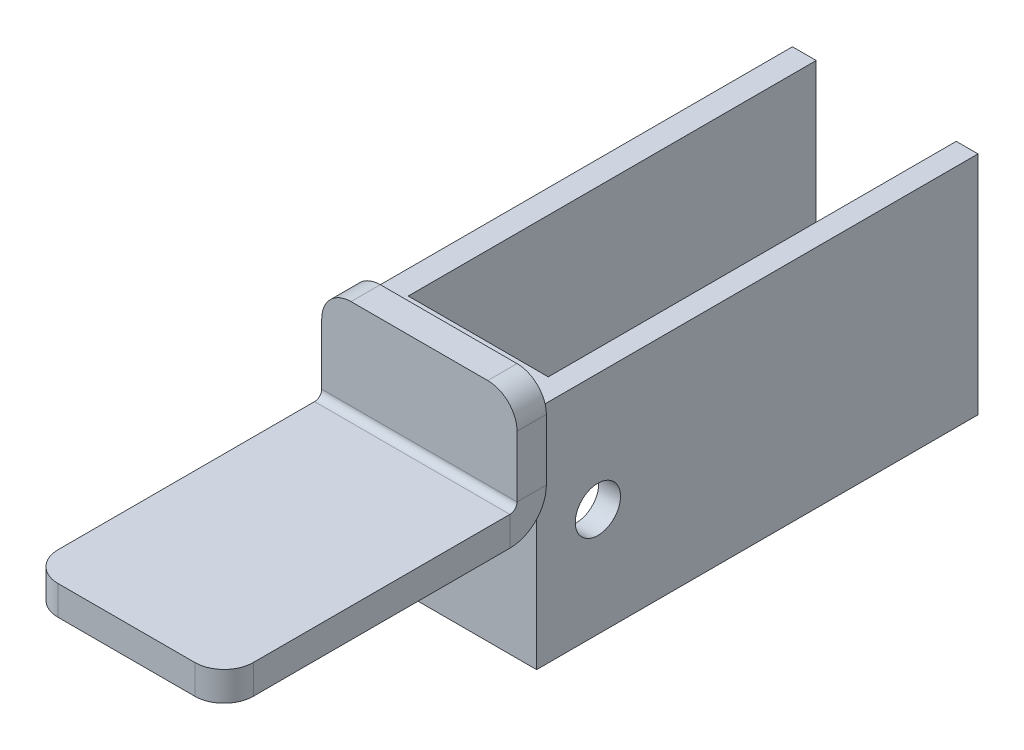
ISO-10303-21;
HEADER;
FILE_DESCRIPTION(('STEP AP214'),'2;1');
FILE_NAME('part.step','',(''),(''),'','','');
FILE_SCHEMA(('AUTOMOTIVE_DESIGN { 1 0 10303 214 1 1 1 1 }'));
ENDSEC;
DATA;
#1=APPLICATION_CONTEXT('core data for automotive mechanical design processes');
#2=APPLICATION_PROTOCOL_DEFINITION('international standard','automotive_design',2000,#1);
#3=PRODUCT_CONTEXT('',#1,'mechanical');
#4=PRODUCT('Part','Part','',(#3));
#5=PRODUCT_RELATED_PRODUCT_CATEGORY('part','',(#4));
#6=PRODUCT_DEFINITION_FORMATION('','',#4);
#7=PRODUCT_DEFINITION_CONTEXT('part definition',#1,'design');
#8=PRODUCT_DEFINITION('design','',#6,#7);
#9=PRODUCT_DEFINITION_SHAPE('','',#8);
#10=(LENGTH_UNIT() NAMED_UNIT(*) SI_UNIT(.MILLI.,.METRE.));
#11=(NAMED_UNIT(*) PLANE_ANGLE_UNIT() SI_UNIT($,.RADIAN.));
#12=(NAMED_UNIT(*) SI_UNIT($,.STERADIAN.) SOLID_ANGLE_UNIT());
#13=UNCERTAINTY_MEASURE_WITH_UNIT(LENGTH_MEASURE(1.E-05),#10,'distance_accuracy_value','');
#14=(GEOMETRIC_REPRESENTATION_CONTEXT(3) GLOBAL_UNCERTAINTY_ASSIGNED_CONTEXT((#13)) GLOBAL_UNIT_ASSIGNED_CONTEXT((#10,
#11,#12)) REPRESENTATION_CONTEXT('',''));
#15=CARTESIAN_POINT('',(0.,0.,0.));
#16=DIRECTION('',(0.,0.,1.));
#17=DIRECTION('',(1.,0.,0.));
#18=AXIS2_PLACEMENT_3D('',#15,#16,#17);
#19=CARTESIAN_POINT('',(19.,7.,-78.1989258310634));
#20=DIRECTION('',(0.,0.,-1.));
#21=DIRECTION('',(-1.,0.,0.));
#22=AXIS2_PLACEMENT_3D('',#19,#20,#21);
#23=PLANE('',#22);
#24=DIRECTION('',(0.,-1.,0.));
#25=VECTOR('',#24,1.);
#26=CARTESIAN_POINT('',(16.772765912759,9.85952111161412,-78.1989258310634));
#27=LINE('',#26,#25);
#28=CARTESIAN_POINT('',(16.772765912759,7.,-78.1989258310634));
#29=VERTEX_POINT('',#28);
#30=CARTESIAN_POINT('',(16.772765912759,-16.1404788883859,-78.1989258310634));
#31=VERTEX_POINT('',#30);
#32=EDGE_CURVE('E188',#29,#31,#27,.T.);
#33=ORIENTED_EDGE('',*,*,#32,.F.);
#34=DIRECTION('',(-1.,0.,0.));
#35=VECTOR('',#34,1.);
#36=CARTESIAN_POINT('',(19.,7.,-78.1989258310634));
#37=LINE('',#36,#35);
#38=CARTESIAN_POINT('',(19.,7.,-78.1989258310634));
#39=VERTEX_POINT('',#38);
#40=EDGE_CURVE('E235',#39,#29,#37,.T.);
#41=ORIENTED_EDGE('',*,*,#40,.F.);
#42=DIRECTION('',(0.,-1.,0.));
#43=VECTOR('',#42,1.);
#44=CARTESIAN_POINT('',(19.,7.,-78.1989258310634));
#45=LINE('',#44,#43);
#46=CARTESIAN_POINT('',(19.,-16.1404788883859,-78.1989258310634));
#47=VERTEX_POINT('',#46);
#48=EDGE_CURVE('E211',#39,#47,#45,.T.);
#49=ORIENTED_EDGE('',*,*,#48,.T.);
#50=DIRECTION('',(-1.,0.,0.));
#51=VECTOR('',#50,1.);
#52=CARTESIAN_POINT('',(19.,-16.1404788883859,-78.1989258310634));
#53=LINE('',#52,#51);
#54=EDGE_CURVE('E232',#47,#31,#53,.T.);
#55=ORIENTED_EDGE('',*,*,#54,.T.);
#56=EDGE_LOOP('',(#33,#41,#49,#55));
#57=FACE_BOUND('',#56,.T.);
#58=ADVANCED_FACE('F35',(#57),#23,.T.);
#59=CARTESIAN_POINT('',(20.,0.7366,-30.));
#60=DIRECTION('',(1.,0.,0.));
#61=DIRECTION('',(0.,0.,-1.));
#62=AXIS2_PLACEMENT_3D('',#59,#60,#61);
#63=PLANE('',#62);
#64=DIRECTION('',(0.,0.,-1.));
#65=VECTOR('',#64,1.);
#66=CARTESIAN_POINT('',(20.,0.7366,-30.));
#67=LINE('',#66,#65);
#68=CARTESIAN_POINT('',(20.,0.7366,-30.));
#69=VERTEX_POINT('',#68);
#70=CARTESIAN_POINT('',(20.,0.7366,-33.));
#71=VERTEX_POINT('',#70);
#72=EDGE_CURVE('E302',#69,#71,#67,.T.);
#73=ORIENTED_EDGE('',*,*,#72,.F.);
#74=CARTESIAN_POINT('',(20.,0.7366,-29.2634));
#75=DIRECTION('',(-1.,0.,0.));
#76=DIRECTION('',(0.,0.,1.));
#77=AXIS2_PLACEMENT_3D('',#74,#75,#76);
#78=CIRCLE('',#77,0.7366);
#79=CARTESIAN_POINT('',(20.,0.,-29.2634));
#80=VERTEX_POINT('',#79);
#81=EDGE_CURVE('E250',#80,#69,#78,.F.);
#82=ORIENTED_EDGE('',*,*,#81,.F.);
#83=DIRECTION('',(0.,1.,0.));
#84=VECTOR('',#83,1.);
#85=CARTESIAN_POINT('',(20.,-3.,-29.2634));
#86=LINE('',#85,#84);
#87=CARTESIAN_POINT('',(20.,-3.,-29.2634));
#88=VERTEX_POINT('',#87);
#89=EDGE_CURVE('E299',#88,#80,#86,.T.);
#90=ORIENTED_EDGE('',*,*,#89,.F.);
#91=CARTESIAN_POINT('',(20.,0.7366,-29.2634));
#92=DIRECTION('',(1.,0.,0.));
#93=DIRECTION('',(0.,0.,-1.));
#94=AXIS2_PLACEMENT_3D('',#91,#92,#93);
#95=CIRCLE('',#94,3.7366);
#96=EDGE_CURVE('E257',#88,#71,#95,.T.);
#97=ORIENTED_EDGE('',*,*,#96,.T.);
#98=EDGE_LOOP('',(#73,#82,#90,#97));
#99=FACE_BOUND('',#98,.T.);
#100=ADVANCED_FACE('F389',(#99),#63,.T.);
#101=CARTESIAN_POINT('',(20.,-3.,-29.2634));
#102=DIRECTION('',(1.,0.,0.));
#103=DIRECTION('',(0.,0.,-1.));
#104=AXIS2_PLACEMENT_3D('',#101,#102,#103);
#105=PLANE('',#104);
#106=DIRECTION('',(0.,1.,0.));
#107=VECTOR('',#106,1.);
#108=CARTESIAN_POINT('',(20.,0.,-33.));
#109=LINE('',#108,#107);
#110=CARTESIAN_POINT('',(20.,7.,-33.));
#111=VERTEX_POINT('',#110);
#112=EDGE_CURVE('E243',#71,#111,#109,.T.);
#113=ORIENTED_EDGE('',*,*,#112,.T.);
#114=DIRECTION('',(0.,0.,-1.));
#115=VECTOR('',#114,1.);
#116=CARTESIAN_POINT('',(20.,7.,-29.2634));
#117=LINE('',#116,#115);
#118=CARTESIAN_POINT('',(20.,7.,-30.));
#119=VERTEX_POINT('',#118);
#120=EDGE_CURVE('E337',#111,#119,#117,.F.);
#121=ORIENTED_EDGE('',*,*,#120,.T.);
#122=DIRECTION('',(0.,1.,0.));
#123=VECTOR('',#122,1.);
#124=CARTESIAN_POINT('',(20.,0.,-30.));
#125=LINE('',#124,#123);
#126=EDGE_CURVE('E246',#69,#119,#125,.T.);
#127=ORIENTED_EDGE('',*,*,#126,.F.);
#128=ORIENTED_EDGE('',*,*,#72,.T.);
#129=EDGE_LOOP('',(#113,#121,#127,#128));
#130=FACE_BOUND('',#129,.T.);
#131=ADVANCED_FACE('F396',(#130),#105,.T.);
#132=CARTESIAN_POINT('',(0.,0.,-29.2634));
#133=DIRECTION('',(-1.,0.,0.));
#134=DIRECTION('',(0.,0.,1.));
#135=AXIS2_PLACEMENT_3D('',#132,#133,#134);
#136=PLANE('',#135);
#137=DIRECTION('',(0.,-1.,0.));
#138=VECTOR('',#137,1.);
#139=CARTESIAN_POINT('',(0.,0.,-29.2634));
#140=LINE('',#139,#138);
#141=CARTESIAN_POINT('',(0.,0.,-29.2634));
#142=VERTEX_POINT('',#141);
#143=CARTESIAN_POINT('',(0.,-3.,-29.2634));
#144=VERTEX_POINT('',#143);
#145=EDGE_CURVE('E296',#142,#144,#140,.T.);
#146=ORIENTED_EDGE('',*,*,#145,.F.);
#147=CARTESIAN_POINT('',(0.,0.7366,-29.2634));
#148=DIRECTION('',(-1.,0.,0.));
#149=DIRECTION('',(0.,0.,1.));
#150=AXIS2_PLACEMENT_3D('',#147,#148,#149);
#151=CIRCLE('',#150,0.7366);
#152=CARTESIAN_POINT('',(0.,0.7366,-30.));
#153=VERTEX_POINT('',#152);
#154=EDGE_CURVE('E263',#142,#153,#151,.F.);
#155=ORIENTED_EDGE('',*,*,#154,.T.);
#156=DIRECTION('',(0.,0.,1.));
#157=VECTOR('',#156,1.);
#158=CARTESIAN_POINT('',(0.,0.7366,-33.));
#159=LINE('',#158,#157);
#160=CARTESIAN_POINT('',(0.,0.7366,-33.));
#161=VERTEX_POINT('',#160);
#162=EDGE_CURVE('E294',#161,#153,#159,.T.);
#163=ORIENTED_EDGE('',*,*,#162,.F.);
#164=CARTESIAN_POINT('',(0.,0.7366,-29.2634));
#165=DIRECTION('',(1.,0.,0.));
#166=DIRECTION('',(0.,0.,-1.));
#167=AXIS2_PLACEMENT_3D('',#164,#165,#166);
#168=CIRCLE('',#167,3.7366);
#169=EDGE_CURVE('E247',#144,#161,#168,.T.);
#170=ORIENTED_EDGE('',*,*,#169,.F.);
#171=EDGE_LOOP('',(#146,#155,#163,#170));
#172=FACE_BOUND('',#171,.T.);
#173=ADVANCED_FACE('F385',(#172),#136,.T.);
#174=CARTESIAN_POINT('',(0.,0.7366,-33.));
#175=DIRECTION('',(-1.,0.,0.));
#176=DIRECTION('',(0.,0.,1.));
#177=AXIS2_PLACEMENT_3D('',#174,#175,#176);
#178=PLANE('',#177);
#179=DIRECTION('',(0.,0.,-1.));
#180=VECTOR('',#179,1.);
#181=CARTESIAN_POINT('',(0.,-3.,0.));
#182=LINE('',#181,#180);
#183=CARTESIAN_POINT('',(0.,-3.,-3.));
#184=VERTEX_POINT('',#183);
#185=EDGE_CURVE('E268',#184,#144,#182,.T.);
#186=ORIENTED_EDGE('',*,*,#185,.F.);
#187=DIRECTION('',(0.,1.,0.));
#188=VECTOR('',#187,1.);
#189=CARTESIAN_POINT('',(0.,0.7366,-3.));
#190=LINE('',#189,#188);
#191=CARTESIAN_POINT('',(0.,0.,-3.));
#192=VERTEX_POINT('',#191);
#193=EDGE_CURVE('E319',#184,#192,#190,.T.);
#194=ORIENTED_EDGE('',*,*,#193,.T.);
#195=DIRECTION('',(0.,0.,-1.));
#196=VECTOR('',#195,1.);
#197=CARTESIAN_POINT('',(0.,0.,0.));
#198=LINE('',#197,#196);
#199=EDGE_CURVE('E266',#192,#142,#198,.T.);
#200=ORIENTED_EDGE('',*,*,#199,.T.);
#201=ORIENTED_EDGE('',*,*,#145,.T.);
#202=EDGE_LOOP('',(#186,#194,#200,#201));
#203=FACE_BOUND('',#202,.T.);
#204=ADVANCED_FACE('F374',(#203),#178,.T.);
#205=CARTESIAN_POINT('',(20.,0.,-33.));
#206=DIRECTION('',(0.,0.,1.));
#207=DIRECTION('',(1.,0.,0.));
#208=AXIS2_PLACEMENT_3D('',#205,#206,#207);
#209=PLANE('',#208);
#210=DIRECTION('',(0.,1.,0.));
#211=VECTOR('',#210,1.);
#212=CARTESIAN_POINT('',(19.,7.,-33.));
#213=LINE('',#212,#211);
#214=CARTESIAN_POINT('',(19.,0.7366,-33.));
#215=VERTEX_POINT('',#214);
#216=CARTESIAN_POINT('',(19.,7.,-33.));
#217=VERTEX_POINT('',#216);
#218=EDGE_CURVE('E59',#215,#217,#213,.T.);
#219=ORIENTED_EDGE('',*,*,#218,.T.);
#220=DIRECTION('',(-1.,0.,0.));
#221=VECTOR('',#220,1.);
#222=CARTESIAN_POINT('',(19.,7.,-33.));
#223=LINE('',#222,#221);
#224=CARTESIAN_POINT('',(0.,7.,-33.));
#225=VERTEX_POINT('',#224);
#226=EDGE_CURVE('E217',#217,#225,#223,.T.);
#227=ORIENTED_EDGE('',*,*,#226,.T.);
#228=CARTESIAN_POINT('',(3.,7.,-33.));
#229=DIRECTION('',(0.,0.,1.));
#230=DIRECTION('',(1.,0.,0.));
#231=AXIS2_PLACEMENT_3D('',#228,#229,#230);
#232=CIRCLE('',#231,3.);
#233=CARTESIAN_POINT('',(3.,10.,-33.));
#234=VERTEX_POINT('',#233);
#235=EDGE_CURVE('E308',#225,#234,#232,.F.);
#236=ORIENTED_EDGE('',*,*,#235,.T.);
#237=DIRECTION('',(-1.,0.,0.));
#238=VECTOR('',#237,1.);
#239=CARTESIAN_POINT('',(20.,10.,-33.));
#240=LINE('',#239,#238);
#241=CARTESIAN_POINT('',(17.,10.,-33.));
#242=VERTEX_POINT('',#241);
#243=EDGE_CURVE('E291',#242,#234,#240,.T.);
#244=ORIENTED_EDGE('',*,*,#243,.F.);
#245=CARTESIAN_POINT('',(17.,7.,-33.));
#246=DIRECTION('',(0.,0.,1.));
#247=DIRECTION('',(1.,0.,0.));
#248=AXIS2_PLACEMENT_3D('',#245,#246,#247);
#249=CIRCLE('',#248,3.);
#250=EDGE_CURVE('E306',#242,#111,#249,.F.);
#251=ORIENTED_EDGE('',*,*,#250,.T.);
#252=ORIENTED_EDGE('',*,*,#112,.F.);
#253=DIRECTION('',(-1.,0.,0.));
#254=VECTOR('',#253,1.);
#255=CARTESIAN_POINT('',(20.,0.7366,-33.));
#256=LINE('',#255,#254);
#257=EDGE_CURVE('E260',#71,#215,#256,.T.);
#258=ORIENTED_EDGE('',*,*,#257,.T.);
#259=EDGE_LOOP('',(#219,#227,#236,#244,#251,#252,#258));
#260=FACE_BOUND('',#259,.T.);
#261=ADVANCED_FACE('F371',(#260),#209,.F.);
#262=CARTESIAN_POINT('',(20.,10.,-30.));
#263=DIRECTION('',(0.,1.,0.));
#264=DIRECTION('',(0.,0.,1.));
#265=AXIS2_PLACEMENT_3D('',#262,#263,#264);
#266=PLANE('',#265);
#267=ORIENTED_EDGE('',*,*,#243,.T.);
#268=DIRECTION('',(0.,0.,-1.));
#269=VECTOR('',#268,1.);
#270=CARTESIAN_POINT('',(3.,10.,-30.));
#271=LINE('',#270,#269);
#272=CARTESIAN_POINT('',(3.,10.,-30.));
#273=VERTEX_POINT('',#272);
#274=EDGE_CURVE('E313',#234,#273,#271,.F.);
#275=ORIENTED_EDGE('',*,*,#274,.T.);
#276=DIRECTION('',(-1.,0.,0.));
#277=VECTOR('',#276,1.);
#278=CARTESIAN_POINT('',(20.,10.,-30.));
#279=LINE('',#278,#277);
#280=CARTESIAN_POINT('',(17.,10.,-30.));
#281=VERTEX_POINT('',#280);
#282=EDGE_CURVE('E288',#281,#273,#279,.T.);
#283=ORIENTED_EDGE('',*,*,#282,.F.);
#284=DIRECTION('',(0.,0.,-1.));
#285=VECTOR('',#284,1.);
#286=CARTESIAN_POINT('',(17.,10.,-30.));
#287=LINE('',#286,#285);
#288=EDGE_CURVE('E310',#281,#242,#287,.T.);
#289=ORIENTED_EDGE('',*,*,#288,.T.);
#290=EDGE_LOOP('',(#267,#275,#283,#289));
#291=FACE_BOUND('',#290,.T.);
#292=ADVANCED_FACE('F373',(#291),#266,.T.);
#293=CARTESIAN_POINT('',(20.,0.,-30.));
#294=DIRECTION('',(0.,0.,1.));
#295=DIRECTION('',(1.,0.,0.));
#296=AXIS2_PLACEMENT_3D('',#293,#294,#295);
#297=PLANE('',#296);
#298=ORIENTED_EDGE('',*,*,#282,.T.);
#299=CARTESIAN_POINT('',(3.,7.,-30.));
#300=DIRECTION('',(0.,0.,1.));
#301=DIRECTION('',(1.,0.,0.));
#302=AXIS2_PLACEMENT_3D('',#299,#300,#301);
#303=CIRCLE('',#302,3.);
#304=CARTESIAN_POINT('',(0.,7.,-30.));
#305=VERTEX_POINT('',#304);
#306=EDGE_CURVE('E317',#273,#305,#303,.T.);
#307=ORIENTED_EDGE('',*,*,#306,.T.);
#308=DIRECTION('',(0.,1.,0.));
#309=VECTOR('',#308,1.);
#310=CARTESIAN_POINT('',(0.,0.,-30.));
#311=LINE('',#310,#309);
#312=EDGE_CURVE('E242',#153,#305,#311,.T.);
#313=ORIENTED_EDGE('',*,*,#312,.F.);
#314=DIRECTION('',(-1.,0.,0.));
#315=VECTOR('',#314,1.);
#316=CARTESIAN_POINT('',(20.,0.7366,-30.));
#317=LINE('',#316,#315);
#318=EDGE_CURVE('E285',#69,#153,#317,.T.);
#319=ORIENTED_EDGE('',*,*,#318,.F.);
#320=ORIENTED_EDGE('',*,*,#126,.T.);
#321=CARTESIAN_POINT('',(17.,7.,-30.));
#322=DIRECTION('',(0.,0.,1.));
#323=DIRECTION('',(1.,0.,0.));
#324=AXIS2_PLACEMENT_3D('',#321,#322,#323);
#325=CIRCLE('',#324,3.);
#326=EDGE_CURVE('E315',#119,#281,#325,.T.);
#327=ORIENTED_EDGE('',*,*,#326,.T.);
#328=EDGE_LOOP('',(#298,#307,#313,#319,#320,#327));
#329=FACE_BOUND('',#328,.T.);
#330=ADVANCED_FACE('F381',(#329),#297,.T.);
#331=CARTESIAN_POINT('',(20.,0.7366,-29.2634));
#332=DIRECTION('',(-1.,0.,0.));
#333=DIRECTION('',(0.,0.,1.));
#334=AXIS2_PLACEMENT_3D('',#331,#332,#333);
#335=CYLINDRICAL_SURFACE('',#334,0.7366);
#336=ORIENTED_EDGE('',*,*,#154,.F.);
#337=DIRECTION('',(-1.,0.,0.));
#338=VECTOR('',#337,1.);
#339=CARTESIAN_POINT('',(20.,0.,-29.2634));
#340=LINE('',#339,#338);
#341=EDGE_CURVE('E282',#80,#142,#340,.T.);
#342=ORIENTED_EDGE('',*,*,#341,.F.);
#343=ORIENTED_EDGE('',*,*,#81,.T.);
#344=ORIENTED_EDGE('',*,*,#318,.T.);
#345=EDGE_LOOP('',(#336,#342,#343,#344));
#346=FACE_BOUND('',#345,.T.);
#347=ADVANCED_FACE('F469',(#346),#335,.F.);
#348=CARTESIAN_POINT('',(20.,0.,0.));
#349=DIRECTION('',(0.,1.,0.));
#350=DIRECTION('',(0.,0.,1.));
#351=AXIS2_PLACEMENT_3D('',#348,#349,#350);
#352=PLANE('',#351);
#353=ORIENTED_EDGE('',*,*,#199,.F.);
#354=CARTESIAN_POINT('',(3.,0.,-3.));
#355=DIRECTION('',(0.,1.,0.));
#356=DIRECTION('',(0.,0.,1.));
#357=AXIS2_PLACEMENT_3D('',#354,#355,#356);
#358=CIRCLE('',#357,3.);
#359=CARTESIAN_POINT('',(3.,0.,0.));
#360=VERTEX_POINT('',#359);
#361=EDGE_CURVE('E324',#192,#360,#358,.T.);
#362=ORIENTED_EDGE('',*,*,#361,.T.);
#363=DIRECTION('',(-1.,0.,0.));
#364=VECTOR('',#363,1.);
#365=CARTESIAN_POINT('',(20.,0.,0.));
#366=LINE('',#365,#364);
#367=CARTESIAN_POINT('',(17.,0.,0.));
#368=VERTEX_POINT('',#367);
#369=EDGE_CURVE('E279',#368,#360,#366,.T.);
#370=ORIENTED_EDGE('',*,*,#369,.F.);
#371=CARTESIAN_POINT('',(17.,0.,-3.));
#372=DIRECTION('',(0.,1.,0.));
#373=DIRECTION('',(0.,0.,1.));
#374=AXIS2_PLACEMENT_3D('',#371,#372,#373);
#375=CIRCLE('',#374,3.);
#376=CARTESIAN_POINT('',(20.,0.,-3.));
#377=VERTEX_POINT('',#376);
#378=EDGE_CURVE('E322',#368,#377,#375,.T.);
#379=ORIENTED_EDGE('',*,*,#378,.T.);
#380=DIRECTION('',(0.,0.,-1.));
#381=VECTOR('',#380,1.);
#382=CARTESIAN_POINT('',(20.,0.,0.));
#383=LINE('',#382,#381);
#384=EDGE_CURVE('E253',#377,#80,#383,.T.);
#385=ORIENTED_EDGE('',*,*,#384,.T.);
#386=ORIENTED_EDGE('',*,*,#341,.T.);
#387=EDGE_LOOP('',(#353,#362,#370,#379,#385,#386));
#388=FACE_BOUND('',#387,.T.);
#389=ADVANCED_FACE('F465',(#388),#352,.T.);
#390=CARTESIAN_POINT('',(20.,-3.,0.));
#391=DIRECTION('',(0.,0.,1.));
#392=DIRECTION('',(1.,0.,0.));
#393=AXIS2_PLACEMENT_3D('',#390,#391,#392);
#394=PLANE('',#393);
#395=ORIENTED_EDGE('',*,*,#369,.T.);
#396=DIRECTION('',(0.,1.,0.));
#397=VECTOR('',#396,1.);
#398=CARTESIAN_POINT('',(3.,-3.,0.));
#399=LINE('',#398,#397);
#400=CARTESIAN_POINT('',(3.,-3.,0.));
#401=VERTEX_POINT('',#400);
#402=EDGE_CURVE('E329',#360,#401,#399,.F.);
#403=ORIENTED_EDGE('',*,*,#402,.T.);
#404=DIRECTION('',(-1.,0.,0.));
#405=VECTOR('',#404,1.);
#406=CARTESIAN_POINT('',(20.,-3.,0.));
#407=LINE('',#406,#405);
#408=CARTESIAN_POINT('',(17.,-3.,0.));
#409=VERTEX_POINT('',#408);
#410=EDGE_CURVE('E276',#409,#401,#407,.T.);
#411=ORIENTED_EDGE('',*,*,#410,.F.);
#412=DIRECTION('',(0.,1.,0.));
#413=VECTOR('',#412,1.);
#414=CARTESIAN_POINT('',(17.,0.,0.));
#415=LINE('',#414,#413);
#416=EDGE_CURVE('E326',#409,#368,#415,.T.);
#417=ORIENTED_EDGE('',*,*,#416,.T.);
#418=EDGE_LOOP('',(#395,#403,#411,#417));
#419=FACE_BOUND('',#418,.T.);
#420=ADVANCED_FACE('F461',(#419),#394,.T.);
#421=CARTESIAN_POINT('',(20.,-3.,0.));
#422=DIRECTION('',(0.,1.,0.));
#423=DIRECTION('',(0.,0.,1.));
#424=AXIS2_PLACEMENT_3D('',#421,#422,#423);
#425=PLANE('',#424);
#426=ORIENTED_EDGE('',*,*,#410,.T.);
#427=CARTESIAN_POINT('',(3.,-3.,-3.));
#428=DIRECTION('',(0.,1.,0.));
#429=DIRECTION('',(0.,0.,1.));
#430=AXIS2_PLACEMENT_3D('',#427,#428,#429);
#431=CIRCLE('',#430,3.);
#432=EDGE_CURVE('E333',#401,#184,#431,.F.);
#433=ORIENTED_EDGE('',*,*,#432,.T.);
#434=ORIENTED_EDGE('',*,*,#185,.T.);
#435=DIRECTION('',(-1.,0.,0.));
#436=VECTOR('',#435,1.);
#437=CARTESIAN_POINT('',(20.,-3.,-29.2634));
#438=LINE('',#437,#436);
#439=EDGE_CURVE('E273',#88,#144,#438,.T.);
#440=ORIENTED_EDGE('',*,*,#439,.F.);
#441=DIRECTION('',(0.,0.,-1.));
#442=VECTOR('',#441,1.);
#443=CARTESIAN_POINT('',(20.,-3.,0.));
#444=LINE('',#443,#442);
#445=CARTESIAN_POINT('',(20.,-3.,-3.));
#446=VERTEX_POINT('',#445);
#447=EDGE_CURVE('E255',#446,#88,#444,.T.);
#448=ORIENTED_EDGE('',*,*,#447,.F.);
#449=CARTESIAN_POINT('',(17.,-3.,-3.));
#450=DIRECTION('',(0.,1.,0.));
#451=DIRECTION('',(0.,0.,1.));
#452=AXIS2_PLACEMENT_3D('',#449,#450,#451);
#453=CIRCLE('',#452,3.);
#454=EDGE_CURVE('E331',#446,#409,#453,.F.);
#455=ORIENTED_EDGE('',*,*,#454,.T.);
#456=EDGE_LOOP('',(#426,#433,#434,#440,#448,#455));
#457=FACE_BOUND('',#456,.T.);
#458=ADVANCED_FACE('F457',(#457),#425,.F.);
#459=CARTESIAN_POINT('',(20.,0.7366,-29.2634));
#460=DIRECTION('',(-1.,0.,0.));
#461=DIRECTION('',(0.,0.,1.));
#462=AXIS2_PLACEMENT_3D('',#459,#460,#461);
#463=CYLINDRICAL_SURFACE('',#462,3.7366);
#464=ORIENTED_EDGE('',*,*,#169,.T.);
#465=DIRECTION('',(-1.,0.,0.));
#466=VECTOR('',#465,1.);
#467=CARTESIAN_POINT('',(20.,0.7366,-33.));
#468=LINE('',#467,#466);
#469=EDGE_CURVE('E231',#215,#161,#468,.T.);
#470=ORIENTED_EDGE('',*,*,#469,.F.);
#471=ORIENTED_EDGE('',*,*,#257,.F.);
#472=ORIENTED_EDGE('',*,*,#96,.F.);
#473=ORIENTED_EDGE('',*,*,#439,.T.);
#474=EDGE_LOOP('',(#464,#470,#471,#472,#473));
#475=FACE_BOUND('',#474,.T.);
#476=ADVANCED_FACE('F452',(#475),#463,.T.);
#477=CARTESIAN_POINT('',(20.,0.7366,-29.2634));
#478=DIRECTION('',(-1.,0.,0.));
#479=DIRECTION('',(0.,0.,1.));
#480=AXIS2_PLACEMENT_3D('',#477,#478,#479);
#481=PLANE('',#480);
#482=ORIENTED_EDGE('',*,*,#384,.F.);
#483=DIRECTION('',(0.,1.,0.));
#484=VECTOR('',#483,1.);
#485=CARTESIAN_POINT('',(20.,-3.,-3.));
#486=LINE('',#485,#484);
#487=EDGE_CURVE('E335',#377,#446,#486,.F.);
#488=ORIENTED_EDGE('',*,*,#487,.T.);
#489=ORIENTED_EDGE('',*,*,#447,.T.);
#490=ORIENTED_EDGE('',*,*,#89,.T.);
#491=EDGE_LOOP('',(#482,#488,#489,#490));
#492=FACE_BOUND('',#491,.T.);
#493=ADVANCED_FACE('F444',(#492),#481,.F.);
#494=CARTESIAN_POINT('',(0.,0.7366,-29.2634));
#495=DIRECTION('',(-1.,0.,0.));
#496=DIRECTION('',(0.,0.,1.));
#497=AXIS2_PLACEMENT_3D('',#494,#495,#496);
#498=PLANE('',#497);
#499=CARTESIAN_POINT('',(0.,-5.06070668528524,-39.2760247054279));
#500=DIRECTION('',(-1.,0.,0.));
#501=DIRECTION('',(0.,0.,1.));
#502=AXIS2_PLACEMENT_3D('',#499,#500,#501);
#503=CIRCLE('',#502,2.3154910673167);
#504=CARTESIAN_POINT('',(0.,-5.06070668528524,-36.9605336381112));
#505=VERTEX_POINT('',#504);
#506=EDGE_CURVE('E438',#505,#505,#503,.T.);
#507=ORIENTED_EDGE('',*,*,#506,.F.);
#508=EDGE_LOOP('',(#507));
#509=FACE_BOUND('',#508,.T.);
#510=ORIENTED_EDGE('',*,*,#312,.T.);
#511=DIRECTION('',(0.,0.,-1.));
#512=VECTOR('',#511,1.);
#513=CARTESIAN_POINT('',(0.,7.,-29.2634));
#514=LINE('',#513,#512);
#515=EDGE_CURVE('E304',#305,#225,#514,.T.);
#516=ORIENTED_EDGE('',*,*,#515,.T.);
#517=DIRECTION('',(0.,0.,-1.));
#518=VECTOR('',#517,1.);
#519=CARTESIAN_POINT('',(0.,7.,-33.));
#520=LINE('',#519,#518);
#521=CARTESIAN_POINT('',(0.,7.,-78.1989258310634));
#522=VERTEX_POINT('',#521);
#523=EDGE_CURVE('E220',#225,#522,#520,.T.);
#524=ORIENTED_EDGE('',*,*,#523,.T.);
#525=DIRECTION('',(0.,-1.,0.));
#526=VECTOR('',#525,1.);
#527=CARTESIAN_POINT('',(0.,7.,-78.1989258310634));
#528=LINE('',#527,#526);
#529=CARTESIAN_POINT('',(0.,-16.1404788883859,-78.1989258310634));
#530=VERTEX_POINT('',#529);
#531=EDGE_CURVE('E223',#522,#530,#528,.T.);
#532=ORIENTED_EDGE('',*,*,#531,.T.);
#533=DIRECTION('',(0.,0.,1.));
#534=VECTOR('',#533,1.);
#535=CARTESIAN_POINT('',(0.,-16.1404788883859,-33.));
#536=LINE('',#535,#534);
#537=CARTESIAN_POINT('',(0.,-16.1404788883859,-33.));
#538=VERTEX_POINT('',#537);
#539=EDGE_CURVE('E226',#530,#538,#536,.T.);
#540=ORIENTED_EDGE('',*,*,#539,.T.);
#541=DIRECTION('',(0.,1.,0.));
#542=VECTOR('',#541,1.);
#543=CARTESIAN_POINT('',(0.,7.,-33.));
#544=LINE('',#543,#542);
#545=EDGE_CURVE('E200',#538,#161,#544,.T.);
#546=ORIENTED_EDGE('',*,*,#545,.T.);
#547=ORIENTED_EDGE('',*,*,#162,.T.);
#548=EDGE_LOOP('',(#510,#516,#524,#532,#540,#546,#547));
#549=FACE_BOUND('',#548,.T.);
#550=ADVANCED_FACE('F358',(#509,#549),#498,.T.);
#551=CARTESIAN_POINT('',(3.,7.,-29.2634));
#552=DIRECTION('',(0.,0.,-1.));
#553=DIRECTION('',(-1.,0.,0.));
#554=AXIS2_PLACEMENT_3D('',#551,#552,#553);
#555=CYLINDRICAL_SURFACE('',#554,3.);
#556=ORIENTED_EDGE('',*,*,#306,.F.);
#557=ORIENTED_EDGE('',*,*,#274,.F.);
#558=ORIENTED_EDGE('',*,*,#235,.F.);
#559=ORIENTED_EDGE('',*,*,#515,.F.);
#560=EDGE_LOOP('',(#556,#557,#558,#559));
#561=FACE_BOUND('',#560,.T.);
#562=ADVANCED_FACE('F369',(#561),#555,.T.);
#563=CARTESIAN_POINT('',(3.,0.7366,-3.));
#564=DIRECTION('',(0.,1.,0.));
#565=DIRECTION('',(0.,0.,1.));
#566=AXIS2_PLACEMENT_3D('',#563,#564,#565);
#567=CYLINDRICAL_SURFACE('',#566,3.);
#568=ORIENTED_EDGE('',*,*,#432,.F.);
#569=ORIENTED_EDGE('',*,*,#402,.F.);
#570=ORIENTED_EDGE('',*,*,#361,.F.);
#571=ORIENTED_EDGE('',*,*,#193,.F.);
#572=EDGE_LOOP('',(#568,#569,#570,#571));
#573=FACE_BOUND('',#572,.T.);
#574=ADVANCED_FACE('F449',(#573),#567,.T.);
#575=CARTESIAN_POINT('',(17.,-3.,-3.));
#576=DIRECTION('',(0.,-1.,0.));
#577=DIRECTION('',(0.,0.,-1.));
#578=AXIS2_PLACEMENT_3D('',#575,#576,#577);
#579=CYLINDRICAL_SURFACE('',#578,3.);
#580=ORIENTED_EDGE('',*,*,#454,.F.);
#581=ORIENTED_EDGE('',*,*,#487,.F.);
#582=ORIENTED_EDGE('',*,*,#378,.F.);
#583=ORIENTED_EDGE('',*,*,#416,.F.);
#584=EDGE_LOOP('',(#580,#581,#582,#583));
#585=FACE_BOUND('',#584,.T.);
#586=ADVANCED_FACE('F506',(#585),#579,.T.);
#587=CARTESIAN_POINT('',(17.,7.,-30.));
#588=DIRECTION('',(0.,0.,-1.));
#589=DIRECTION('',(-1.,0.,0.));
#590=AXIS2_PLACEMENT_3D('',#587,#588,#589);
#591=CYLINDRICAL_SURFACE('',#590,3.);
#592=ORIENTED_EDGE('',*,*,#326,.F.);
#593=ORIENTED_EDGE('',*,*,#120,.F.);
#594=ORIENTED_EDGE('',*,*,#250,.F.);
#595=ORIENTED_EDGE('',*,*,#288,.F.);
#596=EDGE_LOOP('',(#592,#593,#594,#595));
#597=FACE_BOUND('',#596,.T.);
#598=ADVANCED_FACE('F37',(#597),#591,.T.);
#599=CARTESIAN_POINT('',(19.,7.,-33.));
#600=DIRECTION('',(0.,0.,1.));
#601=DIRECTION('',(1.,0.,0.));
#602=AXIS2_PLACEMENT_3D('',#599,#600,#601);
#603=PLANE('',#602);
#604=CARTESIAN_POINT('',(19.,-16.1404788883859,-33.));
#605=VERTEX_POINT('',#604);
#606=EDGE_CURVE('E205',#605,#215,#213,.T.);
#607=ORIENTED_EDGE('',*,*,#606,.T.);
#608=ORIENTED_EDGE('',*,*,#469,.T.);
#609=ORIENTED_EDGE('',*,*,#545,.F.);
#610=DIRECTION('',(-1.,0.,0.));
#611=VECTOR('',#610,1.);
#612=CARTESIAN_POINT('',(19.,-16.1404788883859,-33.));
#613=LINE('',#612,#611);
#614=EDGE_CURVE('E229',#605,#538,#613,.T.);
#615=ORIENTED_EDGE('',*,*,#614,.F.);
#616=EDGE_LOOP('',(#607,#608,#609,#615));
#617=FACE_BOUND('',#616,.T.);
#618=ADVANCED_FACE('F356',(#617),#603,.T.);
#619=CARTESIAN_POINT('',(19.,-16.1404788883859,-33.));
#620=DIRECTION('',(0.,-1.,0.));
#621=DIRECTION('',(0.,0.,-1.));
#622=AXIS2_PLACEMENT_3D('',#619,#620,#621);
#623=PLANE('',#622);
#624=DIRECTION('',(0.,0.,1.));
#625=VECTOR('',#624,1.);
#626=CARTESIAN_POINT('',(16.772765912759,-16.1404788883859,-78.1989258310634));
#627=LINE('',#626,#625);
#628=CARTESIAN_POINT('',(16.772765912759,-16.1404788883859,-36.4235998528954));
#629=VERTEX_POINT('',#628);
#630=EDGE_CURVE('E185',#31,#629,#627,.T.);
#631=ORIENTED_EDGE('',*,*,#630,.F.);
#632=ORIENTED_EDGE('',*,*,#54,.F.);
#633=DIRECTION('',(0.,0.,1.));
#634=VECTOR('',#633,1.);
#635=CARTESIAN_POINT('',(19.,-16.1404788883859,-33.));
#636=LINE('',#635,#634);
#637=EDGE_CURVE('E214',#47,#605,#636,.T.);
#638=ORIENTED_EDGE('',*,*,#637,.T.);
#639=ORIENTED_EDGE('',*,*,#614,.T.);
#640=ORIENTED_EDGE('',*,*,#539,.F.);
#641=CARTESIAN_POINT('',(2.43507835734702,-16.1404788883859,-78.1989258310634));
#642=VERTEX_POINT('',#641);
#643=EDGE_CURVE('E234',#642,#530,#53,.T.);
#644=ORIENTED_EDGE('',*,*,#643,.F.);
#645=DIRECTION('',(0.,0.,-1.));
#646=VECTOR('',#645,1.);
#647=CARTESIAN_POINT('',(2.43507835734702,-16.1404788883859,-78.1989258310634));
#648=LINE('',#647,#646);
#649=CARTESIAN_POINT('',(2.43507835734702,-16.1404788883859,-36.4235998528954));
#650=VERTEX_POINT('',#649);
#651=EDGE_CURVE('E182',#650,#642,#648,.T.);
#652=ORIENTED_EDGE('',*,*,#651,.F.);
#653=DIRECTION('',(-1.,0.,0.));
#654=VECTOR('',#653,1.);
#655=CARTESIAN_POINT('',(16.772765912759,-16.1404788883859,-36.4235998528954));
#656=LINE('',#655,#654);
#657=EDGE_CURVE('E176',#629,#650,#656,.T.);
#658=ORIENTED_EDGE('',*,*,#657,.F.);
#659=EDGE_LOOP('',(#631,#632,#638,#639,#640,#644,#652,#658));
#660=FACE_BOUND('',#659,.T.);
#661=ADVANCED_FACE('F193',(#660),#623,.T.);
#662=DIRECTION('',(0.,-1.,0.));
#663=VECTOR('',#662,1.);
#664=CARTESIAN_POINT('',(2.43507835734702,9.85952111161412,-78.1989258310634));
#665=LINE('',#664,#663);
#666=CARTESIAN_POINT('',(2.43507835734702,7.,-78.1989258310634));
#667=VERTEX_POINT('',#666);
#668=EDGE_CURVE('E201',#667,#642,#665,.T.);
#669=ORIENTED_EDGE('',*,*,#668,.T.);
#670=ORIENTED_EDGE('',*,*,#643,.T.);
#671=ORIENTED_EDGE('',*,*,#531,.F.);
#672=EDGE_CURVE('E238',#667,#522,#37,.T.);
#673=ORIENTED_EDGE('',*,*,#672,.F.);
#674=EDGE_LOOP('',(#669,#670,#671,#673));
#675=FACE_BOUND('',#674,.T.);
#676=ADVANCED_FACE('F361',(#675),#23,.T.);
#677=CARTESIAN_POINT('',(19.,7.,-33.));
#678=DIRECTION('',(0.,1.,0.));
#679=DIRECTION('',(0.,0.,1.));
#680=AXIS2_PLACEMENT_3D('',#677,#678,#679);
#681=PLANE('',#680);
#682=DIRECTION('',(0.,0.,-1.));
#683=VECTOR('',#682,1.);
#684=CARTESIAN_POINT('',(16.772765912759,7.,-33.));
#685=LINE('',#684,#683);
#686=CARTESIAN_POINT('',(16.772765912759,7.,-36.4235998528954));
#687=VERTEX_POINT('',#686);
#688=EDGE_CURVE('E11',#687,#29,#685,.T.);
#689=ORIENTED_EDGE('',*,*,#688,.F.);
#690=DIRECTION('',(1.,0.,0.));
#691=VECTOR('',#690,1.);
#692=CARTESIAN_POINT('',(19.,7.,-36.4235998528954));
#693=LINE('',#692,#691);
#694=CARTESIAN_POINT('',(2.43507835734702,7.,-36.4235998528954));
#695=VERTEX_POINT('',#694);
#696=EDGE_CURVE('E179',#695,#687,#693,.T.);
#697=ORIENTED_EDGE('',*,*,#696,.F.);
#698=DIRECTION('',(0.,0.,1.));
#699=VECTOR('',#698,1.);
#700=CARTESIAN_POINT('',(2.43507835734702,7.,-33.));
#701=LINE('',#700,#699);
#702=EDGE_CURVE('E44',#667,#695,#701,.T.);
#703=ORIENTED_EDGE('',*,*,#702,.F.);
#704=ORIENTED_EDGE('',*,*,#672,.T.);
#705=ORIENTED_EDGE('',*,*,#523,.F.);
#706=ORIENTED_EDGE('',*,*,#226,.F.);
#707=DIRECTION('',(0.,0.,-1.));
#708=VECTOR('',#707,1.);
#709=CARTESIAN_POINT('',(19.,7.,-33.));
#710=LINE('',#709,#708);
#711=EDGE_CURVE('E208',#217,#39,#710,.T.);
#712=ORIENTED_EDGE('',*,*,#711,.T.);
#713=ORIENTED_EDGE('',*,*,#40,.T.);
#714=EDGE_LOOP('',(#689,#697,#703,#704,#705,#706,#712,#713));
#715=FACE_BOUND('',#714,.T.);
#716=ADVANCED_FACE('F345',(#715),#681,.T.);
#717=CARTESIAN_POINT('',(19.,0.,0.));
#718=DIRECTION('',(1.,0.,0.));
#719=DIRECTION('',(0.,0.,-1.));
#720=AXIS2_PLACEMENT_3D('',#717,#718,#719);
#721=PLANE('',#720);
#722=CARTESIAN_POINT('',(19.,-5.06070668528524,-39.2760247054279));
#723=DIRECTION('',(1.,0.,0.));
#724=DIRECTION('',(0.,0.,-1.));
#725=AXIS2_PLACEMENT_3D('',#722,#723,#724);
#726=CIRCLE('',#725,2.3154910673167);
#727=CARTESIAN_POINT('',(19.,-5.06070668528524,-41.5915157727446));
#728=VERTEX_POINT('',#727);
#729=EDGE_CURVE('E191',#728,#728,#726,.T.);
#730=ORIENTED_EDGE('',*,*,#729,.F.);
#731=EDGE_LOOP('',(#730));
#732=FACE_BOUND('',#731,.T.);
#733=ORIENTED_EDGE('',*,*,#606,.F.);
#734=ORIENTED_EDGE('',*,*,#637,.F.);
#735=ORIENTED_EDGE('',*,*,#48,.F.);
#736=ORIENTED_EDGE('',*,*,#711,.F.);
#737=ORIENTED_EDGE('',*,*,#218,.F.);
#738=EDGE_LOOP('',(#733,#734,#735,#736,#737));
#739=FACE_BOUND('',#738,.T.);
#740=ADVANCED_FACE('F353',(#732,#739),#721,.T.);
#741=CARTESIAN_POINT('',(16.772765912759,9.85952111161412,-78.1989258310634));
#742=DIRECTION('',(1.,0.,0.));
#743=DIRECTION('',(0.,0.,-1.));
#744=AXIS2_PLACEMENT_3D('',#741,#742,#743);
#745=PLANE('',#744);
#746=CARTESIAN_POINT('',(16.772765912759,-5.06070668528524,-39.2760247054279));
#747=DIRECTION('',(1.,0.,0.));
#748=DIRECTION('',(0.,0.,-1.));
#749=AXIS2_PLACEMENT_3D('',#746,#747,#748);
#750=CIRCLE('',#749,2.3154910673167);
#751=CARTESIAN_POINT('',(16.772765912759,-5.06070668528524,-41.5915157727446));
#752=VERTEX_POINT('',#751);
#753=EDGE_CURVE('E435',#752,#752,#750,.T.);
#754=ORIENTED_EDGE('',*,*,#753,.T.);
#755=EDGE_LOOP('',(#754));
#756=FACE_BOUND('',#755,.T.);
#757=ORIENTED_EDGE('',*,*,#688,.T.);
#758=ORIENTED_EDGE('',*,*,#32,.T.);
#759=ORIENTED_EDGE('',*,*,#630,.T.);
#760=DIRECTION('',(0.,-1.,0.));
#761=VECTOR('',#760,1.);
#762=CARTESIAN_POINT('',(16.772765912759,9.85952111161412,-36.4235998528954));
#763=LINE('',#762,#761);
#764=EDGE_CURVE('E172',#687,#629,#763,.T.);
#765=ORIENTED_EDGE('',*,*,#764,.F.);
#766=EDGE_LOOP('',(#757,#758,#759,#765));
#767=FACE_BOUND('',#766,.T.);
#768=ADVANCED_FACE('F186',(#756,#767),#745,.F.);
#769=CARTESIAN_POINT('',(2.43507835734702,9.85952111161412,-78.1989258310634));
#770=DIRECTION('',(-1.,0.,0.));
#771=DIRECTION('',(0.,0.,1.));
#772=AXIS2_PLACEMENT_3D('',#769,#770,#771);
#773=PLANE('',#772);
#774=CARTESIAN_POINT('',(2.43507835734702,-5.06070668528524,-39.2760247054279));
#775=DIRECTION('',(-1.,0.,0.));
#776=DIRECTION('',(0.,0.,1.));
#777=AXIS2_PLACEMENT_3D('',#774,#775,#776);
#778=CIRCLE('',#777,2.3154910673167);
#779=CARTESIAN_POINT('',(2.43507835734702,-5.06070668528524,-36.9605336381112));
#780=VERTEX_POINT('',#779);
#781=EDGE_CURVE('E39',#780,#780,#778,.T.);
#782=ORIENTED_EDGE('',*,*,#781,.T.);
#783=EDGE_LOOP('',(#782));
#784=FACE_BOUND('',#783,.T.);
#785=ORIENTED_EDGE('',*,*,#702,.T.);
#786=DIRECTION('',(0.,-1.,0.));
#787=VECTOR('',#786,1.);
#788=CARTESIAN_POINT('',(2.43507835734702,9.85952111161412,-36.4235998528954));
#789=LINE('',#788,#787);
#790=EDGE_CURVE('E51',#695,#650,#789,.T.);
#791=ORIENTED_EDGE('',*,*,#790,.T.);
#792=ORIENTED_EDGE('',*,*,#651,.T.);
#793=ORIENTED_EDGE('',*,*,#668,.F.);
#794=EDGE_LOOP('',(#785,#791,#792,#793));
#795=FACE_BOUND('',#794,.T.);
#796=ADVANCED_FACE('F342',(#784,#795),#773,.F.);
#797=CARTESIAN_POINT('',(16.772765912759,9.85952111161412,-36.4235998528954));
#798=DIRECTION('',(0.,0.,1.));
#799=DIRECTION('',(1.,0.,0.));
#800=AXIS2_PLACEMENT_3D('',#797,#798,#799);
#801=PLANE('',#800);
#802=ORIENTED_EDGE('',*,*,#696,.T.);
#803=ORIENTED_EDGE('',*,*,#764,.T.);
#804=ORIENTED_EDGE('',*,*,#657,.T.);
#805=ORIENTED_EDGE('',*,*,#790,.F.);
#806=EDGE_LOOP('',(#802,#803,#804,#805));
#807=FACE_BOUND('',#806,.T.);
#808=ADVANCED_FACE('F174',(#807),#801,.F.);
#809=CARTESIAN_POINT('',(26.,-5.06070668528524,-39.2760247054279));
#810=DIRECTION('',(-1.,0.,0.));
#811=DIRECTION('',(0.,0.,1.));
#812=AXIS2_PLACEMENT_3D('',#809,#810,#811);
#813=CYLINDRICAL_SURFACE('',#812,2.3154910673167);
#814=ORIENTED_EDGE('',*,*,#506,.T.);
#815=EDGE_LOOP('',(#814));
#816=FACE_BOUND('',#815,.T.);
#817=ORIENTED_EDGE('',*,*,#781,.F.);
#818=EDGE_LOOP('',(#817));
#819=FACE_BOUND('',#818,.T.);
#820=ADVANCED_FACE('F419',(#816,#819),#813,.F.);
#821=ORIENTED_EDGE('',*,*,#729,.T.);
#822=EDGE_LOOP('',(#821));
#823=FACE_BOUND('',#822,.T.);
#824=ORIENTED_EDGE('',*,*,#753,.F.);
#825=EDGE_LOOP('',(#824));
#826=FACE_BOUND('',#825,.T.);
#827=ADVANCED_FACE('F423',(#823,#826),#813,.F.);
#828=CLOSED_SHELL('',(#58,#100,#131,#173,#204,#261,#292,#330,#347,#389,#420,#458,#476,#493,#550,
#562,#574,#586,#598,#618,#661,#676,#716,#740,#768,#796,#808,#820,#827));
#829=MANIFOLD_SOLID_BREP('B2',#828);
#830=ADVANCED_BREP_SHAPE_REPRESENTATION('',(#18,#829),#14);
#831=SHAPE_DEFINITION_REPRESENTATION(#9,#830);
ENDSEC;
END-ISO-10303-21;
